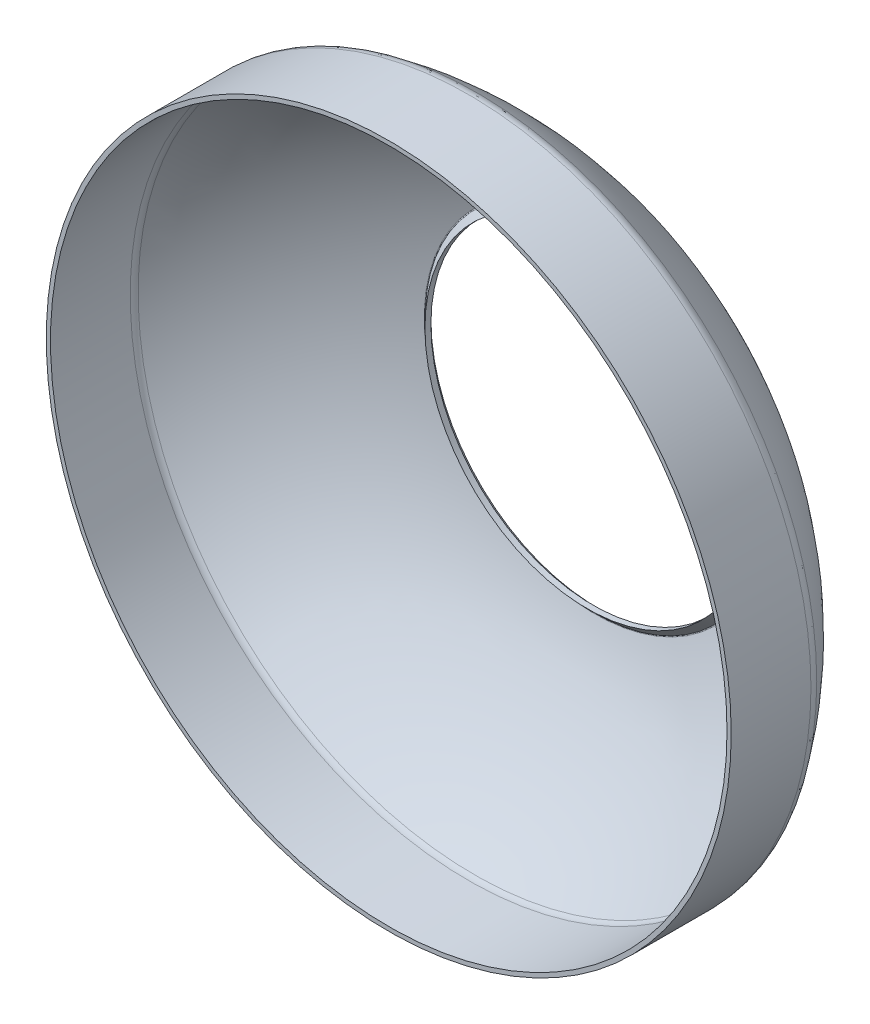
ISO-10303-21;
HEADER;
FILE_DESCRIPTION(('STEP AP214'),'2;1');
FILE_NAME('part.step','',(''),(''),'','','');
FILE_SCHEMA(('AUTOMOTIVE_DESIGN { 1 0 10303 214 1 1 1 1 }'));
ENDSEC;
DATA;
#1=APPLICATION_CONTEXT('core data for automotive mechanical design processes');
#2=APPLICATION_PROTOCOL_DEFINITION('international standard','automotive_design',2000,#1);
#3=PRODUCT_CONTEXT('',#1,'mechanical');
#4=PRODUCT('Part','Part','',(#3));
#5=PRODUCT_RELATED_PRODUCT_CATEGORY('part','',(#4));
#6=PRODUCT_DEFINITION_FORMATION('','',#4);
#7=PRODUCT_DEFINITION_CONTEXT('part definition',#1,'design');
#8=PRODUCT_DEFINITION('design','',#6,#7);
#9=PRODUCT_DEFINITION_SHAPE('','',#8);
#10=(LENGTH_UNIT() NAMED_UNIT(*) SI_UNIT(.MILLI.,.METRE.));
#11=(NAMED_UNIT(*) PLANE_ANGLE_UNIT() SI_UNIT($,.RADIAN.));
#12=(NAMED_UNIT(*) SI_UNIT($,.STERADIAN.) SOLID_ANGLE_UNIT());
#13=UNCERTAINTY_MEASURE_WITH_UNIT(LENGTH_MEASURE(1.E-05),#10,'distance_accuracy_value','');
#14=(GEOMETRIC_REPRESENTATION_CONTEXT(3) GLOBAL_UNCERTAINTY_ASSIGNED_CONTEXT((#13)) GLOBAL_UNIT_ASSIGNED_CONTEXT((#10,
#11,#12)) REPRESENTATION_CONTEXT('',''));
#15=CARTESIAN_POINT('',(0.,0.,0.));
#16=DIRECTION('',(0.,0.,1.));
#17=DIRECTION('',(1.,0.,0.));
#18=AXIS2_PLACEMENT_3D('',#15,#16,#17);
#19=CARTESIAN_POINT('',(-32.5,0.,0.));
#20=DIRECTION('',(0.,0.,-1.));
#21=DIRECTION('',(-1.,0.,0.));
#22=AXIS2_PLACEMENT_3D('',#19,#20,#21);
#23=PLANE('',#22);
#24=CARTESIAN_POINT('',(0.,0.,0.));
#25=DIRECTION('',(0.,0.,1.));
#26=DIRECTION('',(1.,0.,0.));
#27=AXIS2_PLACEMENT_3D('',#24,#25,#26);
#28=CIRCLE('',#27,32.1);
#29=CARTESIAN_POINT('',(32.1,0.,0.));
#30=VERTEX_POINT('',#29);
#31=EDGE_CURVE('E72',#30,#30,#28,.T.);
#32=ORIENTED_EDGE('',*,*,#31,.F.);
#33=EDGE_LOOP('',(#32));
#34=FACE_BOUND('',#33,.T.);
#35=CARTESIAN_POINT('',(0.,0.,0.));
#36=DIRECTION('',(0.,0.,1.));
#37=DIRECTION('',(1.,0.,0.));
#38=AXIS2_PLACEMENT_3D('',#35,#36,#37);
#39=CIRCLE('',#38,32.5);
#40=CARTESIAN_POINT('',(32.5,0.,0.));
#41=VERTEX_POINT('',#40);
#42=EDGE_CURVE('E10',#41,#41,#39,.T.);
#43=ORIENTED_EDGE('',*,*,#42,.T.);
#44=EDGE_LOOP('',(#43));
#45=FACE_BOUND('',#44,.T.);
#46=ADVANCED_FACE('F32',(#34,#45),#23,.F.);
#47=CARTESIAN_POINT('',(0.,0.,0.));
#48=DIRECTION('',(0.,0.,1.));
#49=DIRECTION('',(1.,0.,0.));
#50=AXIS2_PLACEMENT_3D('',#47,#48,#49);
#51=CYLINDRICAL_SURFACE('',#50,32.5);
#52=ORIENTED_EDGE('',*,*,#42,.F.);
#53=EDGE_LOOP('',(#52));
#54=FACE_BOUND('',#53,.T.);
#55=CARTESIAN_POINT('',(0.,0.,-7.56510394160605));
#56=DIRECTION('',(0.,0.,1.));
#57=DIRECTION('',(1.,0.,0.));
#58=AXIS2_PLACEMENT_3D('',#55,#56,#57);
#59=CIRCLE('',#58,32.5);
#60=CARTESIAN_POINT('',(32.5,0.,-7.56510394160605));
#61=VERTEX_POINT('',#60);
#62=EDGE_CURVE('E38',#61,#61,#59,.T.);
#63=ORIENTED_EDGE('',*,*,#62,.T.);
#64=EDGE_LOOP('',(#63));
#65=FACE_BOUND('',#64,.T.);
#66=ADVANCED_FACE('F79',(#54,#65),#51,.T.);
#67=CARTESIAN_POINT('',(0.,0.,-7.56510394160605));
#68=DIRECTION('',(0.,0.,1.));
#69=DIRECTION('',(1.,0.,0.));
#70=AXIS2_PLACEMENT_3D('',#67,#68,#69);
#71=TOROIDAL_SURFACE('',#70,31.1,1.4);
#72=ORIENTED_EDGE('',*,*,#62,.F.);
#73=EDGE_LOOP('',(#72));
#74=FACE_BOUND('',#73,.T.);
#75=CARTESIAN_POINT('',(0.,0.,-8.36699364008347));
#76=DIRECTION('',(0.,0.,1.));
#77=DIRECTION('',(1.,0.,0.));
#78=AXIS2_PLACEMENT_3D('',#75,#76,#77);
#79=CIRCLE('',#78,32.2475944019887);
#80=CARTESIAN_POINT('',(32.2475944019887,0.,-8.36699364008347));
#81=VERTEX_POINT('',#80);
#82=EDGE_CURVE('E42',#81,#81,#79,.T.);
#83=ORIENTED_EDGE('',*,*,#82,.T.);
#84=EDGE_LOOP('',(#83));
#85=FACE_BOUND('',#84,.T.);
#86=ADVANCED_FACE('F83',(#74,#85),#71,.T.);
#87=CARTESIAN_POINT('',(0.,0.,8.81635704157543));
#88=DIRECTION('',(0.,0.,1.));
#89=DIRECTION('',(1.,0.,0.));
#90=AXIS2_PLACEMENT_3D('',#87,#88,#89);
#91=DEGENERATE_TOROIDAL_SURFACE('',#90,7.65628578794515,30.,.T.);
#92=ORIENTED_EDGE('',*,*,#82,.F.);
#93=EDGE_LOOP('',(#92));
#94=FACE_BOUND('',#93,.T.);
#95=CARTESIAN_POINT('',(0.,0.,-19.9152436722169));
#96=DIRECTION('',(0.,0.,1.));
#97=DIRECTION('',(1.,0.,0.));
#98=AXIS2_PLACEMENT_3D('',#95,#96,#97);
#99=CIRCLE('',#98,16.2873413678385);
#100=CARTESIAN_POINT('',(16.2873413678385,0.,-19.9152436722169));
#101=VERTEX_POINT('',#100);
#102=EDGE_CURVE('E46',#101,#101,#99,.T.);
#103=ORIENTED_EDGE('',*,*,#102,.T.);
#104=EDGE_LOOP('',(#103));
#105=FACE_BOUND('',#104,.T.);
#106=ADVANCED_FACE('F88',(#94,#105),#91,.T.);
#107=CARTESIAN_POINT('',(0.,0.,-19.4363836603204));
#108=DIRECTION('',(0.,0.,1.));
#109=DIRECTION('',(1.,0.,0.));
#110=AXIS2_PLACEMENT_3D('',#107,#108,#109);
#111=TOROIDAL_SURFACE('',#110,16.1434904415069,0.500000000000004);
#112=ORIENTED_EDGE('',*,*,#102,.F.);
#113=EDGE_LOOP('',(#112));
#114=FACE_BOUND('',#113,.T.);
#115=CARTESIAN_POINT('',(0.,0.,-19.7899370509136));
#116=DIRECTION('',(0.,0.,1.));
#117=DIRECTION('',(1.,0.,0.));
#118=AXIS2_PLACEMENT_3D('',#115,#116,#117);
#119=CIRCLE('',#118,15.7899370509136);
#120=CARTESIAN_POINT('',(15.7899370509136,0.,-19.7899370509136));
#121=VERTEX_POINT('',#120);
#122=EDGE_CURVE('E51',#121,#121,#119,.T.);
#123=ORIENTED_EDGE('',*,*,#122,.T.);
#124=EDGE_LOOP('',(#123));
#125=FACE_BOUND('',#124,.T.);
#126=ADVANCED_FACE('F94',(#114,#125),#111,.T.);
#127=CARTESIAN_POINT('',(0.,0.,-19.4));
#128=DIRECTION('',(0.,0.,-1.));
#129=DIRECTION('',(-1.,0.,0.));
#130=AXIS2_PLACEMENT_3D('',#127,#128,#129);
#131=CONICAL_SURFACE('',#130,15.4,0.785398163397435);
#132=ORIENTED_EDGE('',*,*,#122,.F.);
#133=EDGE_LOOP('',(#132));
#134=FACE_BOUND('',#133,.T.);
#135=CARTESIAN_POINT('',(0.,0.,-19.4));
#136=DIRECTION('',(0.,0.,1.));
#137=DIRECTION('',(1.,0.,0.));
#138=AXIS2_PLACEMENT_3D('',#135,#136,#137);
#139=CIRCLE('',#138,15.4);
#140=CARTESIAN_POINT('',(15.4,0.,-19.4));
#141=VERTEX_POINT('',#140);
#142=EDGE_CURVE('E54',#141,#141,#139,.T.);
#143=ORIENTED_EDGE('',*,*,#142,.T.);
#144=EDGE_LOOP('',(#143));
#145=FACE_BOUND('',#144,.T.);
#146=ADVANCED_FACE('F98',(#134,#145),#131,.F.);
#147=CARTESIAN_POINT('',(0.,0.,0.));
#148=DIRECTION('',(0.,0.,1.));
#149=DIRECTION('',(1.,0.,0.));
#150=AXIS2_PLACEMENT_3D('',#147,#148,#149);
#151=CYLINDRICAL_SURFACE('',#150,15.4);
#152=ORIENTED_EDGE('',*,*,#142,.F.);
#153=EDGE_LOOP('',(#152));
#154=FACE_BOUND('',#153,.T.);
#155=CARTESIAN_POINT('',(0.,0.,-18.8343145750508));
#156=DIRECTION('',(0.,0.,1.));
#157=DIRECTION('',(1.,0.,0.));
#158=AXIS2_PLACEMENT_3D('',#155,#156,#157);
#159=CIRCLE('',#158,15.4);
#160=CARTESIAN_POINT('',(15.4,0.,-18.8343145750508));
#161=VERTEX_POINT('',#160);
#162=EDGE_CURVE('E57',#161,#161,#159,.T.);
#163=ORIENTED_EDGE('',*,*,#162,.T.);
#164=EDGE_LOOP('',(#163));
#165=FACE_BOUND('',#164,.T.);
#166=ADVANCED_FACE('F102',(#154,#165),#151,.F.);
#167=CARTESIAN_POINT('',(0.,0.,-19.507094338439));
#168=DIRECTION('',(0.,0.,-1.));
#169=DIRECTION('',(-1.,0.,0.));
#170=AXIS2_PLACEMENT_3D('',#167,#168,#169);
#171=CONICAL_SURFACE('',#170,16.0727797633883,0.785398163397443);
#172=ORIENTED_EDGE('',*,*,#162,.F.);
#173=EDGE_LOOP('',(#172));
#174=FACE_BOUND('',#173,.T.);
#175=CARTESIAN_POINT('',(0.,0.,-19.507094338439));
#176=DIRECTION('',(0.,0.,1.));
#177=DIRECTION('',(1.,0.,0.));
#178=AXIS2_PLACEMENT_3D('',#175,#176,#177);
#179=CIRCLE('',#178,16.0727797633883);
#180=CARTESIAN_POINT('',(16.0727797633883,0.,-19.507094338439));
#181=VERTEX_POINT('',#180);
#182=EDGE_CURVE('E60',#181,#181,#179,.T.);
#183=ORIENTED_EDGE('',*,*,#182,.T.);
#184=EDGE_LOOP('',(#183));
#185=FACE_BOUND('',#184,.T.);
#186=ADVANCED_FACE('F106',(#174,#185),#171,.T.);
#187=CARTESIAN_POINT('',(0.,0.,-19.4363836603204));
#188=DIRECTION('',(0.,0.,1.));
#189=DIRECTION('',(1.,0.,0.));
#190=AXIS2_PLACEMENT_3D('',#187,#188,#189);
#191=TOROIDAL_SURFACE('',#190,16.1434904415069,0.100000000000004);
#192=ORIENTED_EDGE('',*,*,#182,.F.);
#193=EDGE_LOOP('',(#192));
#194=FACE_BOUND('',#193,.T.);
#195=CARTESIAN_POINT('',(0.,0.,-19.5321556626997));
#196=DIRECTION('',(0.,0.,1.));
#197=DIRECTION('',(1.,0.,0.));
#198=AXIS2_PLACEMENT_3D('',#195,#196,#197);
#199=CIRCLE('',#198,16.1722606267732);
#200=CARTESIAN_POINT('',(16.1722606267732,0.,-19.5321556626997));
#201=VERTEX_POINT('',#200);
#202=EDGE_CURVE('E63',#201,#201,#199,.T.);
#203=ORIENTED_EDGE('',*,*,#202,.T.);
#204=EDGE_LOOP('',(#203));
#205=FACE_BOUND('',#204,.T.);
#206=ADVANCED_FACE('F110',(#194,#205),#191,.F.);
#207=CARTESIAN_POINT('',(0.,0.,8.81635704157543));
#208=DIRECTION('',(0.,0.,1.));
#209=DIRECTION('',(1.,0.,0.));
#210=AXIS2_PLACEMENT_3D('',#207,#208,#209);
#211=DEGENERATE_TOROIDAL_SURFACE('',#210,7.65628578794515,29.6,.T.);
#212=ORIENTED_EDGE('',*,*,#202,.F.);
#213=EDGE_LOOP('',(#212));
#214=FACE_BOUND('',#213,.T.);
#215=CARTESIAN_POINT('',(0.,0.,-8.13788229766135));
#216=DIRECTION('',(0.,0.,1.));
#217=DIRECTION('',(1.,0.,0.));
#218=AXIS2_PLACEMENT_3D('',#215,#216,#217);
#219=CIRCLE('',#218,31.9197102871348);
#220=CARTESIAN_POINT('',(31.9197102871348,0.,-8.13788229766135));
#221=VERTEX_POINT('',#220);
#222=EDGE_CURVE('E66',#221,#221,#219,.T.);
#223=ORIENTED_EDGE('',*,*,#222,.T.);
#224=EDGE_LOOP('',(#223));
#225=FACE_BOUND('',#224,.T.);
#226=ADVANCED_FACE('F114',(#214,#225),#211,.F.);
#227=CARTESIAN_POINT('',(0.,0.,-7.56510394160605));
#228=DIRECTION('',(0.,0.,1.));
#229=DIRECTION('',(1.,0.,0.));
#230=AXIS2_PLACEMENT_3D('',#227,#228,#229);
#231=TOROIDAL_SURFACE('',#230,31.1,0.999999999999999);
#232=ORIENTED_EDGE('',*,*,#222,.F.);
#233=EDGE_LOOP('',(#232));
#234=FACE_BOUND('',#233,.T.);
#235=CARTESIAN_POINT('',(0.,0.,-7.56510394160605));
#236=DIRECTION('',(0.,0.,1.));
#237=DIRECTION('',(1.,0.,0.));
#238=AXIS2_PLACEMENT_3D('',#235,#236,#237);
#239=CIRCLE('',#238,32.1);
#240=CARTESIAN_POINT('',(32.1,0.,-7.56510394160605));
#241=VERTEX_POINT('',#240);
#242=EDGE_CURVE('E69',#241,#241,#239,.T.);
#243=ORIENTED_EDGE('',*,*,#242,.T.);
#244=EDGE_LOOP('',(#243));
#245=FACE_BOUND('',#244,.T.);
#246=ADVANCED_FACE('F118',(#234,#245),#231,.F.);
#247=CARTESIAN_POINT('',(0.,0.,0.));
#248=DIRECTION('',(0.,0.,1.));
#249=DIRECTION('',(1.,0.,0.));
#250=AXIS2_PLACEMENT_3D('',#247,#248,#249);
#251=CYLINDRICAL_SURFACE('',#250,32.1);
#252=ORIENTED_EDGE('',*,*,#242,.F.);
#253=EDGE_LOOP('',(#252));
#254=FACE_BOUND('',#253,.T.);
#255=ORIENTED_EDGE('',*,*,#31,.T.);
#256=EDGE_LOOP('',(#255));
#257=FACE_BOUND('',#256,.T.);
#258=ADVANCED_FACE('F76',(#254,#257),#251,.F.);
#259=CLOSED_SHELL('',(#46,#66,#86,#106,#126,#146,#166,#186,#206,#226,#246,#258));
#260=MANIFOLD_SOLID_BREP('B2',#259);
#261=ADVANCED_BREP_SHAPE_REPRESENTATION('',(#18,#260),#14);
#262=SHAPE_DEFINITION_REPRESENTATION(#9,#261);
ENDSEC;
END-ISO-10303-21;
